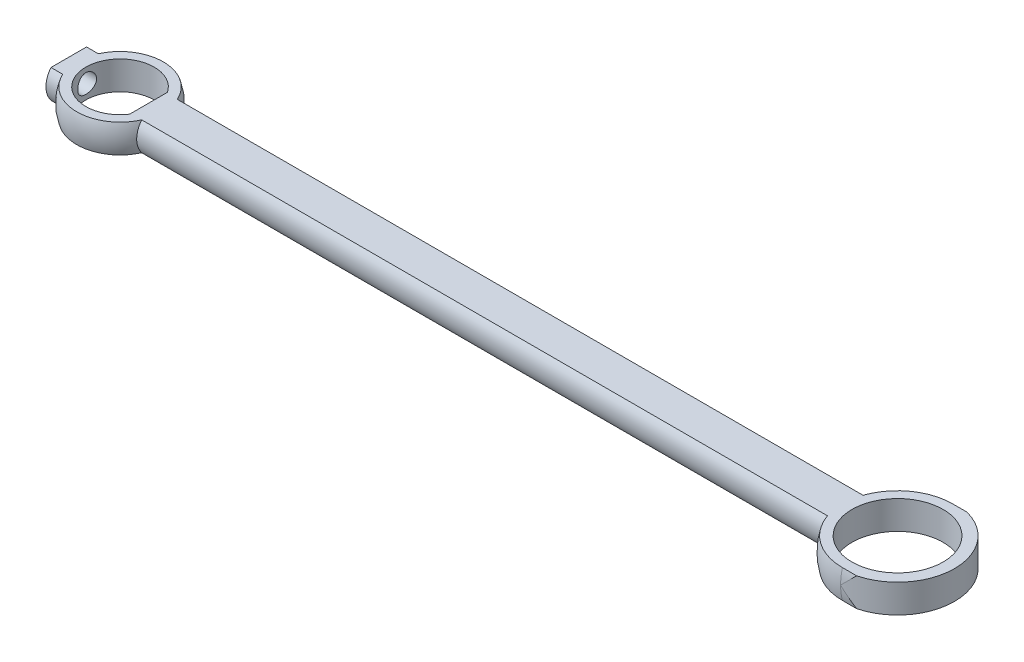
ISO-10303-21;
HEADER;
FILE_DESCRIPTION(('STEP AP214'),'2;1');
FILE_NAME('part.step','',(''),(''),'','','');
FILE_SCHEMA(('AUTOMOTIVE_DESIGN { 1 0 10303 214 1 1 1 1 }'));
ENDSEC;
DATA;
#1=APPLICATION_CONTEXT('core data for automotive mechanical design processes');
#2=APPLICATION_PROTOCOL_DEFINITION('international standard','automotive_design',2000,#1);
#3=PRODUCT_CONTEXT('',#1,'mechanical');
#4=PRODUCT('Part','Part','',(#3));
#5=PRODUCT_RELATED_PRODUCT_CATEGORY('part','',(#4));
#6=PRODUCT_DEFINITION_FORMATION('','',#4);
#7=PRODUCT_DEFINITION_CONTEXT('part definition',#1,'design');
#8=PRODUCT_DEFINITION('design','',#6,#7);
#9=PRODUCT_DEFINITION_SHAPE('','',#8);
#10=(LENGTH_UNIT() NAMED_UNIT(*) SI_UNIT(.MILLI.,.METRE.));
#11=(NAMED_UNIT(*) PLANE_ANGLE_UNIT() SI_UNIT($,.RADIAN.));
#12=(NAMED_UNIT(*) SI_UNIT($,.STERADIAN.) SOLID_ANGLE_UNIT());
#13=UNCERTAINTY_MEASURE_WITH_UNIT(LENGTH_MEASURE(1.E-05),#10,'distance_accuracy_value','');
#14=(GEOMETRIC_REPRESENTATION_CONTEXT(3) GLOBAL_UNCERTAINTY_ASSIGNED_CONTEXT((#13)) GLOBAL_UNIT_ASSIGNED_CONTEXT((#10,
#11,#12)) REPRESENTATION_CONTEXT('',''));
#15=CARTESIAN_POINT('',(0.,0.,0.));
#16=DIRECTION('',(0.,0.,1.));
#17=DIRECTION('',(1.,0.,0.));
#18=AXIS2_PLACEMENT_3D('',#15,#16,#17);
#19=CARTESIAN_POINT('',(100.,1.25,0.));
#20=DIRECTION('',(0.,1.,0.));
#21=DIRECTION('',(0.,0.,1.));
#22=AXIS2_PLACEMENT_3D('',#19,#20,#21);
#23=PLANE('',#22);
#24=CARTESIAN_POINT('',(84.1213232,1.25,0.));
#25=DIRECTION('',(0.,1.,0.));
#26=DIRECTION('',(0.,0.,1.));
#27=AXIS2_PLACEMENT_3D('',#24,#25,#26);
#28=CIRCLE('',#27,4.00000000000001);
#29=CARTESIAN_POINT('',(84.1213232,1.25,4.00000000000001));
#30=VERTEX_POINT('',#29);
#31=EDGE_CURVE('E246',#30,#30,#28,.T.);
#32=ORIENTED_EDGE('',*,*,#31,.F.);
#33=EDGE_LOOP('',(#32));
#34=FACE_BOUND('',#33,.T.);
#35=CARTESIAN_POINT('',(15.8786768,1.25,0.));
#36=DIRECTION('',(0.,1.,0.));
#37=DIRECTION('',(0.,0.,1.));
#38=AXIS2_PLACEMENT_3D('',#35,#36,#37);
#39=CIRCLE('',#38,3.);
#40=CARTESIAN_POINT('',(18.3786768,1.25,-1.65831239517769));
#41=VERTEX_POINT('',#40);
#42=CARTESIAN_POINT('',(18.3786768,1.25,1.6583123951777));
#43=VERTEX_POINT('',#42);
#44=EDGE_CURVE('E238',#41,#43,#39,.T.);
#45=ORIENTED_EDGE('',*,*,#44,.F.);
#46=DIRECTION('',(0.,0.,1.));
#47=VECTOR('',#46,1.);
#48=CARTESIAN_POINT('',(18.3786768,1.25,0.));
#49=LINE('',#48,#47);
#50=EDGE_CURVE('E101',#41,#43,#49,.T.);
#51=ORIENTED_EDGE('',*,*,#50,.T.);
#52=EDGE_LOOP('',(#45,#51));
#53=FACE_BOUND('',#52,.T.);
#54=DIRECTION('',(-1.,0.,0.));
#55=VECTOR('',#54,1.);
#56=CARTESIAN_POINT('',(10.5907572669524,1.25,-1.56124949959959));
#57=LINE('',#56,#55);
#58=CARTESIAN_POINT('',(12.4145751848623,1.25,-1.56124949959959));
#59=VERTEX_POINT('',#58);
#60=CARTESIAN_POINT('',(11.3786768,1.25,-1.56124949959959));
#61=VERTEX_POINT('',#60);
#62=EDGE_CURVE('E196',#59,#61,#57,.T.);
#63=ORIENTED_EDGE('',*,*,#62,.T.);
#64=DIRECTION('',(0.,0.,1.));
#65=VECTOR('',#64,1.);
#66=CARTESIAN_POINT('',(11.3786768,1.25,0.));
#67=LINE('',#66,#65);
#68=CARTESIAN_POINT('',(11.3786768,1.25,1.56124949959961));
#69=VERTEX_POINT('',#68);
#70=EDGE_CURVE('E185',#61,#69,#67,.T.);
#71=ORIENTED_EDGE('',*,*,#70,.T.);
#72=DIRECTION('',(-1.,0.,0.));
#73=VECTOR('',#72,1.);
#74=CARTESIAN_POINT('',(10.5907572669524,1.25,1.56124949959961));
#75=LINE('',#74,#73);
#76=CARTESIAN_POINT('',(12.4145751848623,1.25,1.56124949959961));
#77=VERTEX_POINT('',#76);
#78=EDGE_CURVE('E193',#69,#77,#75,.F.);
#79=ORIENTED_EDGE('',*,*,#78,.T.);
#80=CARTESIAN_POINT('',(15.8786768,1.25,0.));
#81=DIRECTION('',(0.,1.,0.));
#82=DIRECTION('',(0.,0.,1.));
#83=AXIS2_PLACEMENT_3D('',#80,#81,#82);
#84=CIRCLE('',#83,3.79967103839267);
#85=CARTESIAN_POINT('',(19.3427784151378,1.25,1.5612494995996));
#86=VERTEX_POINT('',#85);
#87=EDGE_CURVE('E228',#86,#77,#84,.F.);
#88=ORIENTED_EDGE('',*,*,#87,.F.);
#89=DIRECTION('',(-1.,0.,0.));
#90=VECTOR('',#89,1.);
#91=CARTESIAN_POINT('',(10.5907572669524,1.25,1.5612494995996));
#92=LINE('',#91,#90);
#93=CARTESIAN_POINT('',(79.5387475050442,1.25,1.56124949959959));
#94=VERTEX_POINT('',#93);
#95=EDGE_CURVE('E220',#86,#94,#92,.F.);
#96=ORIENTED_EDGE('',*,*,#95,.T.);
#97=CARTESIAN_POINT('',(84.1213232,1.25,0.));
#98=DIRECTION('',(0.,1.,0.));
#99=DIRECTION('',(0.,0.,1.));
#100=AXIS2_PLACEMENT_3D('',#97,#98,#99);
#101=CIRCLE('',#100,4.84122918275926);
#102=CARTESIAN_POINT('',(84.1213232,1.25,4.84122918275927));
#103=VERTEX_POINT('',#102);
#104=EDGE_CURVE('E219',#103,#94,#101,.F.);
#105=ORIENTED_EDGE('',*,*,#104,.F.);
#106=DIRECTION('',(-1.,0.,0.));
#107=VECTOR('',#106,1.);
#108=CARTESIAN_POINT('',(100.,1.25,4.84122918275927));
#109=LINE('',#108,#107);
#110=CARTESIAN_POINT('',(85.3713232,1.25,4.84122918275927));
#111=VERTEX_POINT('',#110);
#112=EDGE_CURVE('E275',#111,#103,#109,.T.);
#113=ORIENTED_EDGE('',*,*,#112,.F.);
#114=CARTESIAN_POINT('',(84.1213232,1.25,0.));
#115=DIRECTION('',(0.,1.,0.));
#116=DIRECTION('',(0.,0.,1.));
#117=AXIS2_PLACEMENT_3D('',#114,#115,#116);
#118=CIRCLE('',#117,5.);
#119=CARTESIAN_POINT('',(85.3713232,1.25,-4.84122918275927));
#120=VERTEX_POINT('',#119);
#121=EDGE_CURVE('E232',#111,#120,#118,.T.);
#122=ORIENTED_EDGE('',*,*,#121,.T.);
#123=DIRECTION('',(-1.,0.,0.));
#124=VECTOR('',#123,1.);
#125=CARTESIAN_POINT('',(100.,1.25,-4.84122918275927));
#126=LINE('',#125,#124);
#127=CARTESIAN_POINT('',(84.1213232,1.25,-4.84122918275927));
#128=VERTEX_POINT('',#127);
#129=EDGE_CURVE('E263',#120,#128,#126,.T.);
#130=ORIENTED_EDGE('',*,*,#129,.T.);
#131=CARTESIAN_POINT('',(79.5387475050442,1.25,-1.56124949959959));
#132=VERTEX_POINT('',#131);
#133=EDGE_CURVE('E216',#132,#128,#101,.F.);
#134=ORIENTED_EDGE('',*,*,#133,.F.);
#135=DIRECTION('',(-1.,0.,0.));
#136=VECTOR('',#135,1.);
#137=CARTESIAN_POINT('',(10.5907572669524,1.25,-1.56124949959959));
#138=LINE('',#137,#136);
#139=CARTESIAN_POINT('',(19.3427784151378,1.25,-1.56124949959959));
#140=VERTEX_POINT('',#139);
#141=EDGE_CURVE('E224',#132,#140,#138,.T.);
#142=ORIENTED_EDGE('',*,*,#141,.T.);
#143=EDGE_CURVE('E231',#59,#140,#84,.F.);
#144=ORIENTED_EDGE('',*,*,#143,.F.);
#145=EDGE_LOOP('',(#63,#71,#79,#88,#96,#105,#113,#122,#130,#134,#142,#144));
#146=FACE_BOUND('',#145,.T.);
#147=ADVANCED_FACE('F73',(#34,#53,#146),#23,.T.);
#148=CARTESIAN_POINT('',(100.,-1.25,0.));
#149=DIRECTION('',(0.,1.,0.));
#150=DIRECTION('',(0.,0.,1.));
#151=AXIS2_PLACEMENT_3D('',#148,#149,#150);
#152=PLANE('',#151);
#153=DIRECTION('',(0.,0.,1.));
#154=VECTOR('',#153,1.);
#155=CARTESIAN_POINT('',(18.3786768,-1.25,0.));
#156=LINE('',#155,#154);
#157=CARTESIAN_POINT('',(18.3786768,-1.25,-1.65831239517768));
#158=VERTEX_POINT('',#157);
#159=CARTESIAN_POINT('',(18.3786768,-1.25,1.6583123951777));
#160=VERTEX_POINT('',#159);
#161=EDGE_CURVE('E293',#158,#160,#156,.T.);
#162=ORIENTED_EDGE('',*,*,#161,.F.);
#163=CARTESIAN_POINT('',(15.8786768,-1.25,0.));
#164=DIRECTION('',(0.,1.,0.));
#165=DIRECTION('',(0.,0.,1.));
#166=AXIS2_PLACEMENT_3D('',#163,#164,#165);
#167=CIRCLE('',#166,3.);
#168=EDGE_CURVE('E286',#158,#160,#167,.T.);
#169=ORIENTED_EDGE('',*,*,#168,.T.);
#170=EDGE_LOOP('',(#162,#169));
#171=FACE_BOUND('',#170,.T.);
#172=CARTESIAN_POINT('',(84.1213232,-1.25,0.));
#173=DIRECTION('',(0.,1.,0.));
#174=DIRECTION('',(0.,0.,1.));
#175=AXIS2_PLACEMENT_3D('',#172,#173,#174);
#176=CIRCLE('',#175,4.00000000000001);
#177=CARTESIAN_POINT('',(84.1213232,-1.25,4.00000000000001));
#178=VERTEX_POINT('',#177);
#179=EDGE_CURVE('E262',#178,#178,#176,.T.);
#180=ORIENTED_EDGE('',*,*,#179,.T.);
#181=EDGE_LOOP('',(#180));
#182=FACE_BOUND('',#181,.T.);
#183=DIRECTION('',(0.,0.,1.));
#184=VECTOR('',#183,1.);
#185=CARTESIAN_POINT('',(11.3786768,-1.25,0.));
#186=LINE('',#185,#184);
#187=CARTESIAN_POINT('',(11.3786768,-1.25,-1.56124949959959));
#188=VERTEX_POINT('',#187);
#189=CARTESIAN_POINT('',(11.3786768,-1.25,1.56124949959961));
#190=VERTEX_POINT('',#189);
#191=EDGE_CURVE('E94',#188,#190,#186,.T.);
#192=ORIENTED_EDGE('',*,*,#191,.F.);
#193=DIRECTION('',(-1.,0.,0.));
#194=VECTOR('',#193,1.);
#195=CARTESIAN_POINT('',(10.5907572669524,-1.25,-1.5612494995996));
#196=LINE('',#195,#194);
#197=CARTESIAN_POINT('',(12.4145751848623,-1.25,-1.5612494995996));
#198=VERTEX_POINT('',#197);
#199=EDGE_CURVE('E317',#198,#188,#196,.T.);
#200=ORIENTED_EDGE('',*,*,#199,.F.);
#201=CARTESIAN_POINT('',(15.8786768,-1.25,0.));
#202=DIRECTION('',(0.,1.,0.));
#203=DIRECTION('',(0.,0.,1.));
#204=AXIS2_PLACEMENT_3D('',#201,#202,#203);
#205=CIRCLE('',#204,3.79967103839267);
#206=CARTESIAN_POINT('',(19.3427784151378,-1.25,-1.56124949959959));
#207=VERTEX_POINT('',#206);
#208=EDGE_CURVE('E302',#198,#207,#205,.F.);
#209=ORIENTED_EDGE('',*,*,#208,.T.);
#210=DIRECTION('',(-1.,0.,0.));
#211=VECTOR('',#210,1.);
#212=CARTESIAN_POINT('',(10.5907572669524,-1.25,-1.56124949959959));
#213=LINE('',#212,#211);
#214=CARTESIAN_POINT('',(79.5387475050442,-1.25,-1.56124949959959));
#215=VERTEX_POINT('',#214);
#216=EDGE_CURVE('E87',#215,#207,#213,.T.);
#217=ORIENTED_EDGE('',*,*,#216,.F.);
#218=CARTESIAN_POINT('',(84.1213232,-1.25,0.));
#219=DIRECTION('',(0.,1.,0.));
#220=DIRECTION('',(0.,0.,1.));
#221=AXIS2_PLACEMENT_3D('',#218,#219,#220);
#222=CIRCLE('',#221,4.84122918275926);
#223=CARTESIAN_POINT('',(84.1213232,-1.25,-4.84122918275927));
#224=VERTEX_POINT('',#223);
#225=EDGE_CURVE('E205',#215,#224,#222,.F.);
#226=ORIENTED_EDGE('',*,*,#225,.T.);
#227=DIRECTION('',(-1.,0.,0.));
#228=VECTOR('',#227,1.);
#229=CARTESIAN_POINT('',(100.,-1.25,-4.84122918275927));
#230=LINE('',#229,#228);
#231=CARTESIAN_POINT('',(85.3713232,-1.25,-4.84122918275927));
#232=VERTEX_POINT('',#231);
#233=EDGE_CURVE('E267',#232,#224,#230,.T.);
#234=ORIENTED_EDGE('',*,*,#233,.F.);
#235=CARTESIAN_POINT('',(84.1213232,-1.25,0.));
#236=DIRECTION('',(0.,1.,0.));
#237=DIRECTION('',(0.,0.,1.));
#238=AXIS2_PLACEMENT_3D('',#235,#236,#237);
#239=CIRCLE('',#238,5.);
#240=CARTESIAN_POINT('',(85.3713232,-1.25,4.84122918275927));
#241=VERTEX_POINT('',#240);
#242=EDGE_CURVE('E252',#241,#232,#239,.T.);
#243=ORIENTED_EDGE('',*,*,#242,.F.);
#244=DIRECTION('',(-1.,0.,0.));
#245=VECTOR('',#244,1.);
#246=CARTESIAN_POINT('',(100.,-1.25,4.84122918275927));
#247=LINE('',#246,#245);
#248=CARTESIAN_POINT('',(84.1213232,-1.25,4.84122918275927));
#249=VERTEX_POINT('',#248);
#250=EDGE_CURVE('E271',#241,#249,#247,.T.);
#251=ORIENTED_EDGE('',*,*,#250,.T.);
#252=CARTESIAN_POINT('',(79.5387475050442,-1.25,1.56124949959959));
#253=VERTEX_POINT('',#252);
#254=EDGE_CURVE('E211',#249,#253,#222,.F.);
#255=ORIENTED_EDGE('',*,*,#254,.T.);
#256=DIRECTION('',(-1.,0.,0.));
#257=VECTOR('',#256,1.);
#258=CARTESIAN_POINT('',(10.5907572669524,-1.25,1.5612494995996));
#259=LINE('',#258,#257);
#260=CARTESIAN_POINT('',(19.3427784151378,-1.25,1.5612494995996));
#261=VERTEX_POINT('',#260);
#262=EDGE_CURVE('E301',#261,#253,#259,.F.);
#263=ORIENTED_EDGE('',*,*,#262,.F.);
#264=CARTESIAN_POINT('',(12.4145751848623,-1.25,1.56124949959961));
#265=VERTEX_POINT('',#264);
#266=EDGE_CURVE('E297',#261,#265,#205,.F.);
#267=ORIENTED_EDGE('',*,*,#266,.T.);
#268=DIRECTION('',(-1.,0.,0.));
#269=VECTOR('',#268,1.);
#270=CARTESIAN_POINT('',(10.5907572669524,-1.25,1.56124949959961));
#271=LINE('',#270,#269);
#272=EDGE_CURVE('E206',#190,#265,#271,.F.);
#273=ORIENTED_EDGE('',*,*,#272,.F.);
#274=EDGE_LOOP('',(#192,#200,#209,#217,#226,#234,#243,#251,#255,#263,#267,#273));
#275=FACE_BOUND('',#274,.T.);
#276=ADVANCED_FACE('F315',(#171,#182,#275),#152,.F.);
#277=CARTESIAN_POINT('',(10.5907572669524,0.,0.));
#278=DIRECTION('',(-1.,0.,0.));
#279=DIRECTION('',(0.,0.,1.));
#280=AXIS2_PLACEMENT_3D('',#277,#278,#279);
#281=CYLINDRICAL_SURFACE('',#280,2.);
#282=ORIENTED_EDGE('',*,*,#199,.T.);
#283=CARTESIAN_POINT('',(11.3786768,0.,0.));
#284=DIRECTION('',(-1.,0.,0.));
#285=DIRECTION('',(0.,0.,1.));
#286=AXIS2_PLACEMENT_3D('',#283,#284,#285);
#287=CIRCLE('',#286,2.);
#288=EDGE_CURVE('E198',#188,#61,#287,.F.);
#289=ORIENTED_EDGE('',*,*,#288,.T.);
#290=ORIENTED_EDGE('',*,*,#62,.F.);
#291=CARTESIAN_POINT('',(12.4145751848623,0.,0.));
#292=DIRECTION('',(-1.,0.,0.));
#293=DIRECTION('',(0.,0.,1.));
#294=AXIS2_PLACEMENT_3D('',#291,#292,#293);
#295=CIRCLE('',#294,2.);
#296=EDGE_CURVE('E322',#59,#198,#295,.T.);
#297=ORIENTED_EDGE('',*,*,#296,.T.);
#298=EDGE_LOOP('',(#282,#289,#290,#297));
#299=FACE_BOUND('',#298,.T.);
#300=ADVANCED_FACE('F325',(#299),#281,.T.);
#301=ORIENTED_EDGE('',*,*,#78,.F.);
#302=CARTESIAN_POINT('',(11.3786768,0.,0.));
#303=DIRECTION('',(-1.,0.,0.));
#304=DIRECTION('',(0.,0.,1.));
#305=AXIS2_PLACEMENT_3D('',#302,#303,#304);
#306=CIRCLE('',#305,2.);
#307=EDGE_CURVE('E12',#69,#190,#306,.F.);
#308=ORIENTED_EDGE('',*,*,#307,.T.);
#309=ORIENTED_EDGE('',*,*,#272,.T.);
#310=EDGE_CURVE('E203',#265,#77,#295,.T.);
#311=ORIENTED_EDGE('',*,*,#310,.T.);
#312=EDGE_LOOP('',(#301,#308,#309,#311));
#313=FACE_BOUND('',#312,.T.);
#314=ADVANCED_FACE('F201',(#313),#281,.T.);
#315=CARTESIAN_POINT('',(100.,0.,0.));
#316=DIRECTION('',(-1.,0.,0.));
#317=DIRECTION('',(0.,0.,1.));
#318=AXIS2_PLACEMENT_3D('',#315,#316,#317);
#319=CYLINDRICAL_SURFACE('',#318,5.);
#320=CARTESIAN_POINT('',(84.1213232,0.,0.));
#321=DIRECTION('',(-1.,0.,0.));
#322=DIRECTION('',(0.,0.,1.));
#323=AXIS2_PLACEMENT_3D('',#320,#321,#322);
#324=CIRCLE('',#323,5.);
#325=CARTESIAN_POINT('',(84.1213232,0.,5.));
#326=VERTEX_POINT('',#325);
#327=EDGE_CURVE('E333',#326,#103,#324,.T.);
#328=ORIENTED_EDGE('',*,*,#327,.F.);
#329=CARTESIAN_POINT('',(84.1213232,0.,0.));
#330=DIRECTION('',(-0.707106781186547,0.707106781186547,0.));
#331=DIRECTION('',(-0.707106781186547,-0.707106781186547,0.));
#332=AXIS2_PLACEMENT_3D('',#329,#330,#331);
#333=ELLIPSE('',#332,7.07106781186547,5.);
#334=EDGE_CURVE('E258',#111,#326,#333,.F.);
#335=ORIENTED_EDGE('',*,*,#334,.F.);
#336=ORIENTED_EDGE('',*,*,#112,.T.);
#337=EDGE_LOOP('',(#328,#335,#336));
#338=FACE_BOUND('',#337,.T.);
#339=ADVANCED_FACE('F376',(#338),#319,.T.);
#340=EDGE_CURVE('E327',#249,#326,#324,.T.);
#341=ORIENTED_EDGE('',*,*,#340,.F.);
#342=ORIENTED_EDGE('',*,*,#250,.F.);
#343=CARTESIAN_POINT('',(84.1213232,0.,0.));
#344=DIRECTION('',(-0.707106781186547,-0.707106781186547,0.));
#345=DIRECTION('',(-0.707106781186547,0.707106781186547,0.));
#346=AXIS2_PLACEMENT_3D('',#343,#344,#345);
#347=ELLIPSE('',#346,7.07106781186547,5.);
#348=EDGE_CURVE('E255',#326,#241,#347,.F.);
#349=ORIENTED_EDGE('',*,*,#348,.F.);
#350=EDGE_LOOP('',(#341,#342,#349));
#351=FACE_BOUND('',#350,.T.);
#352=ADVANCED_FACE('F387',(#351),#319,.T.);
#353=CARTESIAN_POINT('',(100.,0.,0.));
#354=DIRECTION('',(-1.,0.,0.));
#355=DIRECTION('',(0.,0.,1.));
#356=AXIS2_PLACEMENT_3D('',#353,#354,#355);
#357=CYLINDRICAL_SURFACE('',#356,5.);
#358=CARTESIAN_POINT('',(84.1213232,0.,-5.));
#359=VERTEX_POINT('',#358);
#360=EDGE_CURVE('E338',#128,#359,#324,.T.);
#361=ORIENTED_EDGE('',*,*,#360,.F.);
#362=ORIENTED_EDGE('',*,*,#129,.F.);
#363=CARTESIAN_POINT('',(84.1213232,0.,0.));
#364=DIRECTION('',(-0.707106781186547,0.707106781186547,0.));
#365=DIRECTION('',(-0.707106781186547,-0.707106781186547,0.));
#366=AXIS2_PLACEMENT_3D('',#363,#364,#365);
#367=ELLIPSE('',#366,7.07106781186547,5.);
#368=EDGE_CURVE('E283',#359,#120,#367,.F.);
#369=ORIENTED_EDGE('',*,*,#368,.F.);
#370=EDGE_LOOP('',(#361,#362,#369));
#371=FACE_BOUND('',#370,.T.);
#372=ADVANCED_FACE('F368',(#371),#357,.T.);
#373=EDGE_CURVE('E331',#359,#224,#324,.T.);
#374=ORIENTED_EDGE('',*,*,#373,.F.);
#375=CARTESIAN_POINT('',(84.1213232,0.,0.));
#376=DIRECTION('',(-0.707106781186547,-0.707106781186547,0.));
#377=DIRECTION('',(-0.707106781186547,0.707106781186547,0.));
#378=AXIS2_PLACEMENT_3D('',#375,#376,#377);
#379=ELLIPSE('',#378,7.07106781186547,5.);
#380=EDGE_CURVE('E279',#232,#359,#379,.F.);
#381=ORIENTED_EDGE('',*,*,#380,.F.);
#382=ORIENTED_EDGE('',*,*,#233,.T.);
#383=EDGE_LOOP('',(#374,#381,#382));
#384=FACE_BOUND('',#383,.T.);
#385=ADVANCED_FACE('F362',(#384),#357,.T.);
#386=CARTESIAN_POINT('',(84.1213232,-98.75,0.));
#387=DIRECTION('',(0.,1.,0.));
#388=DIRECTION('',(0.,0.,1.));
#389=AXIS2_PLACEMENT_3D('',#386,#387,#388);
#390=CYLINDRICAL_SURFACE('',#389,5.);
#391=ORIENTED_EDGE('',*,*,#334,.T.);
#392=ORIENTED_EDGE('',*,*,#348,.T.);
#393=ORIENTED_EDGE('',*,*,#242,.T.);
#394=ORIENTED_EDGE('',*,*,#380,.T.);
#395=ORIENTED_EDGE('',*,*,#368,.T.);
#396=ORIENTED_EDGE('',*,*,#121,.F.);
#397=EDGE_LOOP('',(#391,#392,#393,#394,#395,#396));
#398=FACE_BOUND('',#397,.T.);
#399=ADVANCED_FACE('F365',(#398),#390,.T.);
#400=CARTESIAN_POINT('',(84.1213232,-98.75,0.));
#401=DIRECTION('',(0.,1.,0.));
#402=DIRECTION('',(0.,0.,1.));
#403=AXIS2_PLACEMENT_3D('',#400,#401,#402);
#404=CYLINDRICAL_SURFACE('',#403,4.00000000000001);
#405=ORIENTED_EDGE('',*,*,#31,.T.);
#406=EDGE_LOOP('',(#405));
#407=FACE_BOUND('',#406,.T.);
#408=ORIENTED_EDGE('',*,*,#179,.F.);
#409=EDGE_LOOP('',(#408));
#410=FACE_BOUND('',#409,.T.);
#411=ADVANCED_FACE('F411',(#407,#410),#404,.F.);
#412=CARTESIAN_POINT('',(18.3786768,-98.75,0.));
#413=DIRECTION('',(-1.,0.,0.));
#414=DIRECTION('',(0.,0.,1.));
#415=AXIS2_PLACEMENT_3D('',#412,#413,#414);
#416=PLANE('',#415);
#417=ORIENTED_EDGE('',*,*,#161,.T.);
#418=DIRECTION('',(0.,1.,0.));
#419=VECTOR('',#418,1.);
#420=CARTESIAN_POINT('',(18.3786768,-98.75,1.6583123951777));
#421=LINE('',#420,#419);
#422=EDGE_CURVE('E243',#160,#43,#421,.T.);
#423=ORIENTED_EDGE('',*,*,#422,.T.);
#424=ORIENTED_EDGE('',*,*,#50,.F.);
#425=DIRECTION('',(0.,1.,0.));
#426=VECTOR('',#425,1.);
#427=CARTESIAN_POINT('',(18.3786768,-98.75,-1.65831239517768));
#428=LINE('',#427,#426);
#429=EDGE_CURVE('E242',#158,#41,#428,.T.);
#430=ORIENTED_EDGE('',*,*,#429,.F.);
#431=EDGE_LOOP('',(#417,#423,#424,#430));
#432=FACE_BOUND('',#431,.T.);
#433=ADVANCED_FACE('F407',(#432),#416,.T.);
#434=CARTESIAN_POINT('',(15.8786768,-98.75,0.));
#435=DIRECTION('',(0.,1.,0.));
#436=DIRECTION('',(0.,0.,1.));
#437=AXIS2_PLACEMENT_3D('',#434,#435,#436);
#438=CYLINDRICAL_SURFACE('',#437,3.);
#439=CARTESIAN_POINT('',(12.9943441215456,0.,0.824999999999998));
#440=CARTESIAN_POINT('',(12.9943433920859,0.0453902233083933,0.824999018724386));
#441=CARTESIAN_POINT('',(12.993260956749,0.0907906152702679,0.821241290779665));
#442=CARTESIAN_POINT('',(12.989062139696,0.180276353826497,0.80634056581282));
#443=CARTESIAN_POINT('',(12.9859448213447,0.224361085059709,0.79519416782718));
#444=CARTESIAN_POINT('',(12.9780554022663,0.309907893606327,0.765913343563003));
#445=CARTESIAN_POINT('',(12.9732857300257,0.351373714805038,0.747789168287914));
#446=CARTESIAN_POINT('',(12.9626321658181,0.43068360907417,0.705099795927665));
#447=CARTESIAN_POINT('',(12.9567481673806,0.468527335543496,0.680533983276608));
#448=CARTESIAN_POINT('',(12.9443535355662,0.540525231159498,0.624959822594256));
#449=CARTESIAN_POINT('',(12.9378312366892,0.574568805614234,0.593810767315735));
#450=CARTESIAN_POINT('',(12.9249953348084,0.637020600879265,0.526256690535103));
#451=CARTESIAN_POINT('',(12.9186817546785,0.66542820572889,0.489851095290972));
#452=CARTESIAN_POINT('',(12.9068439216865,0.716267401886575,0.412045708960852));
#453=CARTESIAN_POINT('',(12.901335031069,0.738588368189554,0.370571093157895));
#454=CARTESIAN_POINT('',(12.8918615311927,0.775898069387364,0.284280669287763));
#455=CARTESIAN_POINT('',(12.8878966443524,0.790888122360813,0.239465463520826));
#456=CARTESIAN_POINT('',(12.8820403854895,0.812750622341328,0.148921055394555));
#457=CARTESIAN_POINT('',(12.8801009982395,0.819811358008351,0.103240476848601));
#458=CARTESIAN_POINT('',(12.878346085084,0.826207899339836,0.0113047313600297));
#459=CARTESIAN_POINT('',(12.8785301820202,0.825545076808091,-0.0349503320888041));
#460=CARTESIAN_POINT('',(12.8809666097441,0.816644426804581,-0.125409002334329));
#461=CARTESIAN_POINT('',(12.8831633658557,0.808610136008359,-0.169634363092975));
#462=CARTESIAN_POINT('',(12.8893122383166,0.785524307703447,-0.25608312001573));
#463=CARTESIAN_POINT('',(12.8932644578175,0.77047235783271,-0.298306398375575));
#464=CARTESIAN_POINT('',(12.9025612631807,0.733626927226655,-0.380063384954591));
#465=CARTESIAN_POINT('',(12.9079198741872,0.711765099943077,-0.419564630983323));
#466=CARTESIAN_POINT('',(12.9194541977071,0.66197330417669,-0.494406264294431));
#467=CARTESIAN_POINT('',(12.9256300780312,0.634042088702484,-0.529745794223734));
#468=CARTESIAN_POINT('',(12.9383691352702,0.571829694340339,-0.596475924666641));
#469=CARTESIAN_POINT('',(12.9449383746984,0.537371227206229,-0.627700282871787));
#470=CARTESIAN_POINT('',(12.9575434884203,0.463639789041537,-0.683969243099236));
#471=CARTESIAN_POINT('',(12.9635793257611,0.424366484901254,-0.709013417190119));
#472=CARTESIAN_POINT('',(12.9744597658103,0.341741461540408,-0.752348518815771));
#473=CARTESIAN_POINT('',(12.9792958383126,0.298363406367824,-0.770591526706408));
#474=CARTESIAN_POINT('',(12.9871246188601,0.208989192547866,-0.799470045682938));
#475=CARTESIAN_POINT('',(12.9901178176469,0.162993734459525,-0.810107582162416));
#476=CARTESIAN_POINT('',(12.9938166232553,0.071251794605533,-0.823180891623551));
#477=CARTESIAN_POINT('',(12.9945916880495,0.0255435760368062,-0.825865788470362));
#478=CARTESIAN_POINT('',(12.9939570025423,-0.0656692651974009,-0.823646239124183));
#479=CARTESIAN_POINT('',(12.9925475016894,-0.111173910513256,-0.818742659435428));
#480=CARTESIAN_POINT('',(12.9877698586353,-0.19970943934042,-0.801705550400253));
#481=CARTESIAN_POINT('',(12.9844430024777,-0.242772071639694,-0.789724291474218));
#482=CARTESIAN_POINT('',(12.9762464249616,-0.326275841607011,-0.759044404174989));
#483=CARTESIAN_POINT('',(12.9713764928399,-0.366716620255881,-0.740344858128059));
#484=CARTESIAN_POINT('',(12.9605018220681,-0.444864047090254,-0.696261519426785));
#485=CARTESIAN_POINT('',(12.9544733933568,-0.482485579060738,-0.670732821141947));
#486=CARTESIAN_POINT('',(12.942015517779,-0.553002181299873,-0.61389362201205));
#487=CARTESIAN_POINT('',(12.935585990742,-0.585896302295749,-0.58258196281426));
#488=CARTESIAN_POINT('',(12.9228093030281,-0.647071677518778,-0.513908752950552));
#489=CARTESIAN_POINT('',(12.9164708621312,-0.675178492503574,-0.476389851724527));
#490=CARTESIAN_POINT('',(12.9047939550225,-0.724696515221241,-0.397022973235914));
#491=CARTESIAN_POINT('',(12.8994554356923,-0.74610807866426,-0.355175226116632));
#492=CARTESIAN_POINT('',(12.8904142681111,-0.781427206656612,-0.268632509176936));
#493=CARTESIAN_POINT('',(12.8866993254558,-0.795391350467868,-0.223961977205733));
#494=CARTESIAN_POINT('',(12.8812696721959,-0.815579758484129,-0.132790158987631));
#495=CARTESIAN_POINT('',(12.8795544879282,-0.821805855546705,-0.0862893089686759));
#496=CARTESIAN_POINT('',(12.8783415415448,-0.826220595205783,0.00559793865451812));
#497=CARTESIAN_POINT('',(12.8787733904021,-0.824664366131759,0.050971317405392));
#498=CARTESIAN_POINT('',(12.8816451924253,-0.814155209095098,0.140784777328334));
#499=CARTESIAN_POINT('',(12.884085061494,-0.805202590897595,0.185224897505898));
#500=CARTESIAN_POINT('',(12.8906832492118,-0.780302619555723,0.271582872919665));
#501=CARTESIAN_POINT('',(12.8948281248422,-0.764409925954715,0.313517584061939));
#502=CARTESIAN_POINT('',(12.9044042922244,-0.726129583684113,0.394148983210193));
#503=CARTESIAN_POINT('',(12.9098357728792,-0.703740981158256,0.432845194600406));
#504=CARTESIAN_POINT('',(12.9215961776946,-0.652373982006797,0.507077016037108));
#505=CARTESIAN_POINT('',(12.9279459796017,-0.623228555368329,0.542493723072039));
#506=CARTESIAN_POINT('',(12.9407474353583,-0.559488136780142,0.608019739007354));
#507=CARTESIAN_POINT('',(12.9471991161227,-0.524891682323895,0.638127618946347));
#508=CARTESIAN_POINT('',(12.9596516601898,-0.450241097399782,0.692893506341192));
#509=CARTESIAN_POINT('',(12.9656381390165,-0.410076668391595,0.717404747707568));
#510=CARTESIAN_POINT('',(12.9762736355564,-0.326037196990398,0.759293048136391));
#511=CARTESIAN_POINT('',(12.9809234742407,-0.282164453785425,0.776674489171478));
#512=CARTESIAN_POINT('',(12.9877570832433,-0.198751833899278,0.801700978729585));
#513=CARTESIAN_POINT('',(12.9902064705278,-0.159551875992111,0.810416788988246));
#514=CARTESIAN_POINT('',(12.9935002065036,-0.0802371798262223,0.822066352984342));
#515=CARTESIAN_POINT('',(12.9943447663495,-0.0401225626164984,0.825000867395867));
#516=CARTESIAN_POINT('',(12.9943441215456,0.,0.824999999999998));
#517=B_SPLINE_CURVE_WITH_KNOTS('',3,(#439,#440,#441,#442,#443,#444,#445,#446,#447,#448,#449,
#450,#451,#452,#453,#454,#455,#456,#457,#458,#459,#460,#461,#462,#463,#464,#465,#466,#467,#468,
#469,#470,#471,#472,#473,#474,#475,#476,#477,#478,#479,#480,#481,#482,#483,#484,#485,#486,#487,
#488,#489,#490,#491,#492,#493,#494,#495,#496,#497,#498,#499,#500,#501,#502,#503,#504,#505,#506,
#507,#508,#509,#510,#511,#512,#513,#514,#515,#516),.UNSPECIFIED.,.T.,.F.,(4,2,2,2,2,2,2,2,2,2,2,
2,2,2,2,2,2,2,2,2,2,2,2,2,2,2,2,2,2,2,2,2,2,2,2,2,2,2,4),(0.,0.136023025533904,
0.272108705222753,0.40799522060553,0.543894726102875,0.683061922397797,0.822244320044204,
0.963809310890145,1.10534883936295,1.24345121157125,1.38152905538666,1.51590549717544,
1.65028983600353,1.78606890076877,1.92187588856001,2.06210909320015,2.20235200521556,
2.34356515922222,2.48474069309449,2.62144438491236,2.75813246811795,2.89198174216468,
3.02584930609535,3.16282020302364,3.29981856564445,3.44106035798117,3.58229464504667,
3.72244009014633,3.86255233363413,3.99810198215835,4.13364595407119,4.26814112033169,
4.40265604580384,4.54093911463362,4.67925934807963,4.8208716998806,4.96239688590463,
5.08264988724944,5.20288706524676),.UNSPECIFIED.);
#518=CARTESIAN_POINT('',(12.9943441215456,0.,0.824999999999998));
#519=VERTEX_POINT('',#518);
#520=EDGE_CURVE('E76',#519,#519,#517,.T.);
#521=ORIENTED_EDGE('',*,*,#520,.T.);
#522=EDGE_LOOP('',(#521));
#523=FACE_BOUND('',#522,.T.);
#524=ORIENTED_EDGE('',*,*,#429,.T.);
#525=ORIENTED_EDGE('',*,*,#44,.T.);
#526=ORIENTED_EDGE('',*,*,#422,.F.);
#527=ORIENTED_EDGE('',*,*,#168,.F.);
#528=EDGE_LOOP('',(#524,#525,#526,#527));
#529=FACE_BOUND('',#528,.T.);
#530=ADVANCED_FACE('F405',(#523,#529),#438,.F.);
#531=CARTESIAN_POINT('',(84.1213232,0.,0.));
#532=DIRECTION('',(-1.,0.,0.));
#533=DIRECTION('',(0.,0.,-1.));
#534=AXIS2_PLACEMENT_3D('',#531,#532,#533);
#535=SPHERICAL_SURFACE('',#534,4.99999999999999);
#536=ORIENTED_EDGE('',*,*,#133,.T.);
#537=ORIENTED_EDGE('',*,*,#360,.T.);
#538=ORIENTED_EDGE('',*,*,#373,.T.);
#539=ORIENTED_EDGE('',*,*,#225,.F.);
#540=CARTESIAN_POINT('',(79.5387475050442,0.,0.));
#541=DIRECTION('',(-1.,0.,0.));
#542=DIRECTION('',(0.,0.,1.));
#543=AXIS2_PLACEMENT_3D('',#540,#541,#542);
#544=CIRCLE('',#543,1.99999999999999);
#545=EDGE_CURVE('E342',#132,#215,#544,.T.);
#546=ORIENTED_EDGE('',*,*,#545,.F.);
#547=EDGE_LOOP('',(#536,#537,#538,#539,#546));
#548=FACE_BOUND('',#547,.T.);
#549=ADVANCED_FACE('F355',(#548),#535,.T.);
#550=CARTESIAN_POINT('',(10.5907572669524,0.,0.));
#551=DIRECTION('',(-1.,0.,0.));
#552=DIRECTION('',(0.,0.,1.));
#553=AXIS2_PLACEMENT_3D('',#550,#551,#552);
#554=CYLINDRICAL_SURFACE('',#553,2.);
#555=ORIENTED_EDGE('',*,*,#545,.T.);
#556=ORIENTED_EDGE('',*,*,#216,.T.);
#557=CARTESIAN_POINT('',(19.3427784151378,0.,0.));
#558=DIRECTION('',(-1.,0.,0.));
#559=DIRECTION('',(0.,0.,1.));
#560=AXIS2_PLACEMENT_3D('',#557,#558,#559);
#561=CIRCLE('',#560,2.);
#562=EDGE_CURVE('E323',#140,#207,#561,.T.);
#563=ORIENTED_EDGE('',*,*,#562,.F.);
#564=ORIENTED_EDGE('',*,*,#141,.F.);
#565=EDGE_LOOP('',(#555,#556,#563,#564));
#566=FACE_BOUND('',#565,.T.);
#567=ADVANCED_FACE('F428',(#566),#554,.T.);
#568=CARTESIAN_POINT('',(15.8786768,0.,0.));
#569=DIRECTION('',(-1.,0.,0.));
#570=DIRECTION('',(0.,0.,-1.));
#571=AXIS2_PLACEMENT_3D('',#568,#569,#570);
#572=SPHERICAL_SURFACE('',#571,4.);
#573=ORIENTED_EDGE('',*,*,#143,.T.);
#574=ORIENTED_EDGE('',*,*,#562,.T.);
#575=ORIENTED_EDGE('',*,*,#208,.F.);
#576=ORIENTED_EDGE('',*,*,#296,.F.);
#577=EDGE_LOOP('',(#573,#574,#575,#576));
#578=FACE_BOUND('',#577,.T.);
#579=ADVANCED_FACE('F321',(#578),#572,.T.);
#580=ORIENTED_EDGE('',*,*,#87,.T.);
#581=ORIENTED_EDGE('',*,*,#310,.F.);
#582=ORIENTED_EDGE('',*,*,#266,.F.);
#583=EDGE_CURVE('E343',#261,#86,#561,.T.);
#584=ORIENTED_EDGE('',*,*,#583,.T.);
#585=EDGE_LOOP('',(#580,#581,#582,#584));
#586=FACE_BOUND('',#585,.T.);
#587=ADVANCED_FACE('F427',(#586),#572,.T.);
#588=ORIENTED_EDGE('',*,*,#583,.F.);
#589=ORIENTED_EDGE('',*,*,#262,.T.);
#590=EDGE_CURVE('E337',#253,#94,#544,.T.);
#591=ORIENTED_EDGE('',*,*,#590,.T.);
#592=ORIENTED_EDGE('',*,*,#95,.F.);
#593=EDGE_LOOP('',(#588,#589,#591,#592));
#594=FACE_BOUND('',#593,.T.);
#595=ADVANCED_FACE('F431',(#594),#554,.T.);
#596=ORIENTED_EDGE('',*,*,#104,.T.);
#597=ORIENTED_EDGE('',*,*,#590,.F.);
#598=ORIENTED_EDGE('',*,*,#254,.F.);
#599=ORIENTED_EDGE('',*,*,#340,.T.);
#600=ORIENTED_EDGE('',*,*,#327,.T.);
#601=EDGE_LOOP('',(#596,#597,#598,#599,#600));
#602=FACE_BOUND('',#601,.T.);
#603=ADVANCED_FACE('F378',(#602),#535,.T.);
#604=CARTESIAN_POINT('',(11.3786768,100.,-2.5));
#605=DIRECTION('',(-1.,0.,0.));
#606=DIRECTION('',(0.,0.,1.));
#607=AXIS2_PLACEMENT_3D('',#604,#605,#606);
#608=PLANE('',#607);
#609=CARTESIAN_POINT('',(11.3786768,0.,0.));
#610=DIRECTION('',(-1.,0.,0.));
#611=DIRECTION('',(0.,0.,1.));
#612=AXIS2_PLACEMENT_3D('',#609,#610,#611);
#613=CIRCLE('',#612,0.824999999999998);
#614=CARTESIAN_POINT('',(11.3786768,0.,0.824999999999998));
#615=VERTEX_POINT('',#614);
#616=EDGE_CURVE('E447',#615,#615,#613,.T.);
#617=ORIENTED_EDGE('',*,*,#616,.F.);
#618=EDGE_LOOP('',(#617));
#619=FACE_BOUND('',#618,.T.);
#620=ORIENTED_EDGE('',*,*,#191,.T.);
#621=ORIENTED_EDGE('',*,*,#307,.F.);
#622=ORIENTED_EDGE('',*,*,#70,.F.);
#623=ORIENTED_EDGE('',*,*,#288,.F.);
#624=EDGE_LOOP('',(#620,#621,#622,#623));
#625=FACE_BOUND('',#624,.T.);
#626=ADVANCED_FACE('F184',(#619,#625),#608,.T.);
#627=CARTESIAN_POINT('',(11.3786768,0.,0.));
#628=DIRECTION('',(-1.,0.,0.));
#629=DIRECTION('',(0.,0.,1.));
#630=AXIS2_PLACEMENT_3D('',#627,#628,#629);
#631=CYLINDRICAL_SURFACE('',#630,0.824999999999998);
#632=ORIENTED_EDGE('',*,*,#616,.T.);
#633=EDGE_LOOP('',(#632));
#634=FACE_BOUND('',#633,.T.);
#635=ORIENTED_EDGE('',*,*,#520,.F.);
#636=EDGE_LOOP('',(#635));
#637=FACE_BOUND('',#636,.T.);
#638=ADVANCED_FACE('F437',(#634,#637),#631,.F.);
#639=CLOSED_SHELL('',(#147,#276,#300,#314,#339,#352,#372,#385,#399,#411,#433,#530,#549,#567,
#579,#587,#595,#603,#626,#638));
#640=MANIFOLD_SOLID_BREP('B2',#639);
#641=ADVANCED_BREP_SHAPE_REPRESENTATION('',(#18,#640),#14);
#642=SHAPE_DEFINITION_REPRESENTATION(#9,#641);
ENDSEC;
END-ISO-10303-21;
